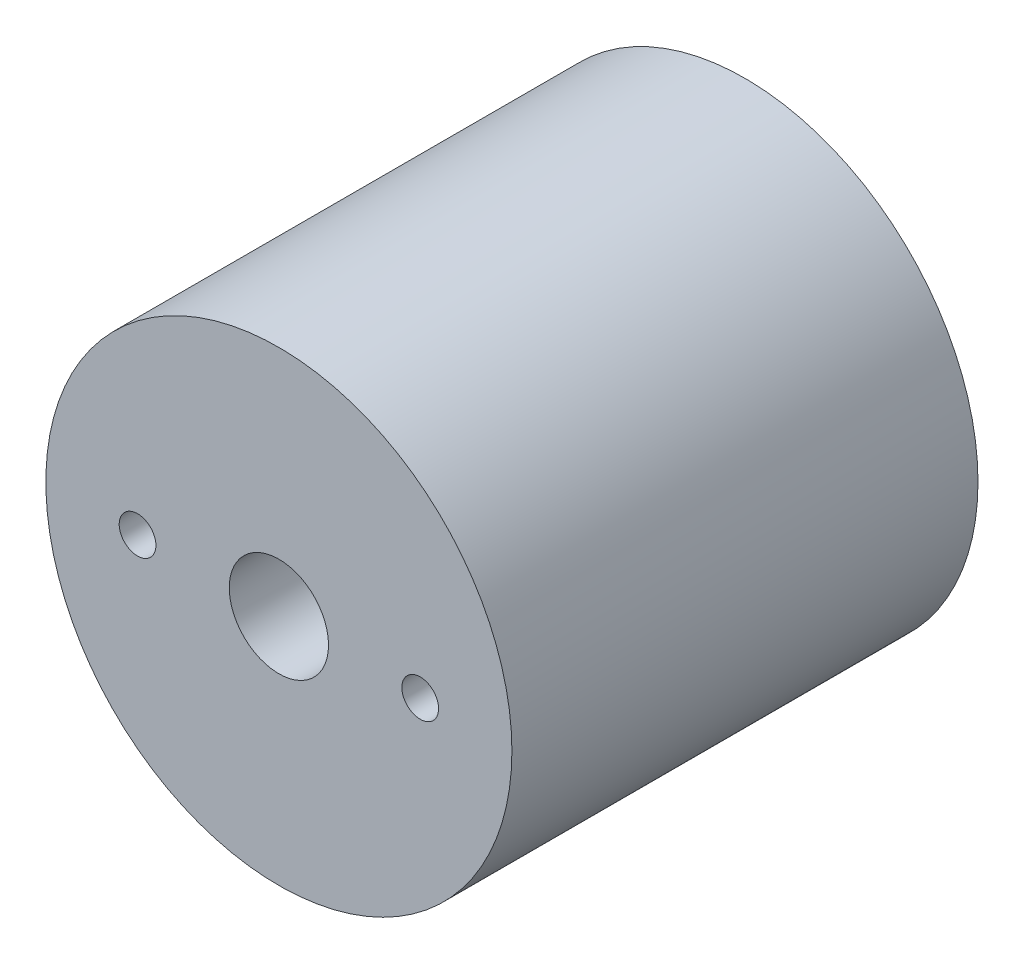
ISO-10303-21;
HEADER;
FILE_DESCRIPTION(('STEP AP214'),'2;1');
FILE_NAME('part.step','',(''),(''),'','','');
FILE_SCHEMA(('AUTOMOTIVE_DESIGN { 1 0 10303 214 1 1 1 1 }'));
ENDSEC;
DATA;
#1=APPLICATION_CONTEXT('core data for automotive mechanical design processes');
#2=APPLICATION_PROTOCOL_DEFINITION('international standard','automotive_design',2000,#1);
#3=PRODUCT_CONTEXT('',#1,'mechanical');
#4=PRODUCT('Part','Part','',(#3));
#5=PRODUCT_RELATED_PRODUCT_CATEGORY('part','',(#4));
#6=PRODUCT_DEFINITION_FORMATION('','',#4);
#7=PRODUCT_DEFINITION_CONTEXT('part definition',#1,'design');
#8=PRODUCT_DEFINITION('design','',#6,#7);
#9=PRODUCT_DEFINITION_SHAPE('','',#8);
#10=(LENGTH_UNIT() NAMED_UNIT(*) SI_UNIT(.MILLI.,.METRE.));
#11=(NAMED_UNIT(*) PLANE_ANGLE_UNIT() SI_UNIT($,.RADIAN.));
#12=(NAMED_UNIT(*) SI_UNIT($,.STERADIAN.) SOLID_ANGLE_UNIT());
#13=UNCERTAINTY_MEASURE_WITH_UNIT(LENGTH_MEASURE(1.E-05),#10,'distance_accuracy_value','');
#14=(GEOMETRIC_REPRESENTATION_CONTEXT(3) GLOBAL_UNCERTAINTY_ASSIGNED_CONTEXT((#13)) GLOBAL_UNIT_ASSIGNED_CONTEXT((#10,
#11,#12)) REPRESENTATION_CONTEXT('',''));
#15=CARTESIAN_POINT('',(0.,0.,0.));
#16=DIRECTION('',(0.,0.,1.));
#17=DIRECTION('',(1.,0.,0.));
#18=AXIS2_PLACEMENT_3D('',#15,#16,#17);
#19=CARTESIAN_POINT('',(0.,0.,25.4));
#20=DIRECTION('',(0.,0.,-1.));
#21=DIRECTION('',(-1.,0.,0.));
#22=AXIS2_PLACEMENT_3D('',#19,#20,#21);
#23=CYLINDRICAL_SURFACE('',#22,12.7);
#24=CARTESIAN_POINT('',(0.,0.,25.4));
#25=DIRECTION('',(0.,0.,1.));
#26=DIRECTION('',(1.,0.,0.));
#27=AXIS2_PLACEMENT_3D('',#24,#25,#26);
#28=CIRCLE('',#27,12.7);
#29=CARTESIAN_POINT('',(12.7,0.,25.4));
#30=VERTEX_POINT('',#29);
#31=EDGE_CURVE('E103',#30,#30,#28,.T.);
#32=ORIENTED_EDGE('',*,*,#31,.F.);
#33=EDGE_LOOP('',(#32));
#34=FACE_BOUND('',#33,.T.);
#35=CARTESIAN_POINT('',(0.,0.,0.));
#36=DIRECTION('',(0.,0.,1.));
#37=DIRECTION('',(1.,0.,0.));
#38=AXIS2_PLACEMENT_3D('',#35,#36,#37);
#39=CIRCLE('',#38,12.7);
#40=CARTESIAN_POINT('',(12.7,0.,0.));
#41=VERTEX_POINT('',#40);
#42=EDGE_CURVE('E98',#41,#41,#39,.T.);
#43=ORIENTED_EDGE('',*,*,#42,.T.);
#44=EDGE_LOOP('',(#43));
#45=FACE_BOUND('',#44,.T.);
#46=ADVANCED_FACE('F35',(#34,#45),#23,.T.);
#47=CARTESIAN_POINT('',(0.,0.,25.4));
#48=DIRECTION('',(0.,0.,1.));
#49=DIRECTION('',(1.,0.,0.));
#50=AXIS2_PLACEMENT_3D('',#47,#48,#49);
#51=PLANE('',#50);
#52=CARTESIAN_POINT('',(7.70254999999999,0.,25.4));
#53=DIRECTION('',(0.,0.,1.));
#54=DIRECTION('',(-1.,0.,0.));
#55=AXIS2_PLACEMENT_3D('',#52,#53,#54);
#56=CIRCLE('',#55,1.);
#57=CARTESIAN_POINT('',(6.70254999999999,0.,25.4));
#58=VERTEX_POINT('',#57);
#59=EDGE_CURVE('E74',#58,#58,#56,.T.);
#60=ORIENTED_EDGE('',*,*,#59,.F.);
#61=EDGE_LOOP('',(#60));
#62=FACE_BOUND('',#61,.T.);
#63=CARTESIAN_POINT('',(-7.70254999999999,0.,25.4));
#64=DIRECTION('',(0.,0.,1.));
#65=DIRECTION('',(1.,0.,0.));
#66=AXIS2_PLACEMENT_3D('',#63,#64,#65);
#67=CIRCLE('',#66,1.);
#68=CARTESIAN_POINT('',(-6.70254999999999,0.,25.4));
#69=VERTEX_POINT('',#68);
#70=EDGE_CURVE('E73',#69,#69,#67,.T.);
#71=ORIENTED_EDGE('',*,*,#70,.F.);
#72=EDGE_LOOP('',(#71));
#73=FACE_BOUND('',#72,.T.);
#74=CARTESIAN_POINT('',(0.,0.,25.4));
#75=DIRECTION('',(0.,0.,1.));
#76=DIRECTION('',(1.,0.,0.));
#77=AXIS2_PLACEMENT_3D('',#74,#75,#76);
#78=CIRCLE('',#77,2.70509999999999);
#79=CARTESIAN_POINT('',(2.70509999999999,0.,25.4));
#80=VERTEX_POINT('',#79);
#81=EDGE_CURVE('E85',#80,#80,#78,.T.);
#82=ORIENTED_EDGE('',*,*,#81,.F.);
#83=EDGE_LOOP('',(#82));
#84=FACE_BOUND('',#83,.T.);
#85=ORIENTED_EDGE('',*,*,#31,.T.);
#86=EDGE_LOOP('',(#85));
#87=FACE_BOUND('',#86,.T.);
#88=ADVANCED_FACE('F128',(#62,#73,#84,#87),#51,.T.);
#89=CARTESIAN_POINT('',(0.,0.,0.));
#90=DIRECTION('',(0.,0.,1.));
#91=DIRECTION('',(1.,0.,0.));
#92=AXIS2_PLACEMENT_3D('',#89,#90,#91);
#93=PLANE('',#92);
#94=CARTESIAN_POINT('',(0.,0.,0.));
#95=DIRECTION('',(0.,0.,-1.));
#96=DIRECTION('',(-1.,0.,0.));
#97=AXIS2_PLACEMENT_3D('',#94,#95,#96);
#98=CIRCLE('',#97,10.4);
#99=CARTESIAN_POINT('',(-10.4,0.,0.));
#100=VERTEX_POINT('',#99);
#101=EDGE_CURVE('E99',#100,#100,#98,.T.);
#102=ORIENTED_EDGE('',*,*,#101,.F.);
#103=EDGE_LOOP('',(#102));
#104=FACE_BOUND('',#103,.T.);
#105=ORIENTED_EDGE('',*,*,#42,.F.);
#106=EDGE_LOOP('',(#105));
#107=FACE_BOUND('',#106,.T.);
#108=ADVANCED_FACE('F134',(#104,#107),#93,.F.);
#109=CARTESIAN_POINT('',(0.,0.,5.5));
#110=DIRECTION('',(0.,0.,-1.));
#111=DIRECTION('',(-1.,0.,0.));
#112=AXIS2_PLACEMENT_3D('',#109,#110,#111);
#113=CYLINDRICAL_SURFACE('',#112,10.4);
#114=CARTESIAN_POINT('',(0.,0.,1.));
#115=DIRECTION('',(0.,0.,-1.));
#116=DIRECTION('',(-1.,0.,0.));
#117=AXIS2_PLACEMENT_3D('',#114,#115,#116);
#118=CIRCLE('',#117,10.4);
#119=CARTESIAN_POINT('',(-10.4,0.,1.));
#120=VERTEX_POINT('',#119);
#121=EDGE_CURVE('E92',#120,#120,#118,.F.);
#122=ORIENTED_EDGE('',*,*,#121,.T.);
#123=EDGE_LOOP('',(#122));
#124=FACE_BOUND('',#123,.T.);
#125=ORIENTED_EDGE('',*,*,#101,.T.);
#126=EDGE_LOOP('',(#125));
#127=FACE_BOUND('',#126,.T.);
#128=ADVANCED_FACE('F142',(#124,#127),#113,.F.);
#129=CARTESIAN_POINT('',(0.,0.,2.8));
#130=DIRECTION('',(0.,0.,-1.));
#131=DIRECTION('',(-1.,0.,0.));
#132=AXIS2_PLACEMENT_3D('',#129,#130,#131);
#133=PLANE('',#132);
#134=CARTESIAN_POINT('',(0.,0.,2.8));
#135=DIRECTION('',(0.,0.,-1.));
#136=DIRECTION('',(-1.,0.,0.));
#137=AXIS2_PLACEMENT_3D('',#134,#135,#136);
#138=CIRCLE('',#137,11.75);
#139=CARTESIAN_POINT('',(-11.75,0.,2.8));
#140=VERTEX_POINT('',#139);
#141=EDGE_CURVE('E89',#140,#140,#138,.T.);
#142=ORIENTED_EDGE('',*,*,#141,.T.);
#143=EDGE_LOOP('',(#142));
#144=FACE_BOUND('',#143,.T.);
#145=CARTESIAN_POINT('',(0.,0.,2.8));
#146=DIRECTION('',(0.,0.,-1.));
#147=DIRECTION('',(-1.,0.,0.));
#148=AXIS2_PLACEMENT_3D('',#145,#146,#147);
#149=CIRCLE('',#148,10.4);
#150=CARTESIAN_POINT('',(-10.4,0.,2.8));
#151=VERTEX_POINT('',#150);
#152=EDGE_CURVE('E102',#151,#151,#149,.F.);
#153=ORIENTED_EDGE('',*,*,#152,.T.);
#154=EDGE_LOOP('',(#153));
#155=FACE_BOUND('',#154,.T.);
#156=ADVANCED_FACE('F147',(#144,#155),#133,.T.);
#157=CARTESIAN_POINT('',(0.,0.,1.));
#158=DIRECTION('',(0.,0.,-1.));
#159=DIRECTION('',(-1.,0.,0.));
#160=AXIS2_PLACEMENT_3D('',#157,#158,#159);
#161=PLANE('',#160);
#162=CARTESIAN_POINT('',(0.,0.,1.));
#163=DIRECTION('',(0.,0.,-1.));
#164=DIRECTION('',(-1.,0.,0.));
#165=AXIS2_PLACEMENT_3D('',#162,#163,#164);
#166=CIRCLE('',#165,11.75);
#167=CARTESIAN_POINT('',(-11.75,0.,1.));
#168=VERTEX_POINT('',#167);
#169=EDGE_CURVE('E88',#168,#168,#166,.T.);
#170=ORIENTED_EDGE('',*,*,#169,.F.);
#171=EDGE_LOOP('',(#170));
#172=FACE_BOUND('',#171,.T.);
#173=ORIENTED_EDGE('',*,*,#121,.F.);
#174=EDGE_LOOP('',(#173));
#175=FACE_BOUND('',#174,.T.);
#176=ADVANCED_FACE('F158',(#172,#175),#161,.F.);
#177=CARTESIAN_POINT('',(0.,0.,2.8));
#178=DIRECTION('',(0.,0.,-1.));
#179=DIRECTION('',(-1.,0.,0.));
#180=AXIS2_PLACEMENT_3D('',#177,#178,#179);
#181=CYLINDRICAL_SURFACE('',#180,11.75);
#182=ORIENTED_EDGE('',*,*,#141,.F.);
#183=EDGE_LOOP('',(#182));
#184=FACE_BOUND('',#183,.T.);
#185=ORIENTED_EDGE('',*,*,#169,.T.);
#186=EDGE_LOOP('',(#185));
#187=FACE_BOUND('',#186,.T.);
#188=ADVANCED_FACE('F155',(#184,#187),#181,.F.);
#189=CARTESIAN_POINT('',(0.,0.,5.5));
#190=DIRECTION('',(0.,0.,-1.));
#191=DIRECTION('',(-1.,0.,0.));
#192=AXIS2_PLACEMENT_3D('',#189,#190,#191);
#193=PLANE('',#192);
#194=CARTESIAN_POINT('',(7.70254999999999,0.,5.5));
#195=DIRECTION('',(0.,0.,-1.));
#196=DIRECTION('',(-1.,0.,0.));
#197=AXIS2_PLACEMENT_3D('',#194,#195,#196);
#198=CIRCLE('',#197,1.);
#199=CARTESIAN_POINT('',(8.64855125448914,0.324162962882815,5.5));
#200=VERTEX_POINT('',#199);
#201=CARTESIAN_POINT('',(8.64855125448914,-0.324162962882819,5.5));
#202=VERTEX_POINT('',#201);
#203=EDGE_CURVE('E53',#200,#202,#198,.T.);
#204=ORIENTED_EDGE('',*,*,#203,.F.);
#205=CARTESIAN_POINT('',(0.,0.,5.5));
#206=DIRECTION('',(0.,0.,1.));
#207=DIRECTION('',(1.,0.,0.));
#208=AXIS2_PLACEMENT_3D('',#205,#206,#207);
#209=CIRCLE('',#208,8.65462422223118);
#210=CARTESIAN_POINT('',(-8.64855125448914,0.324162962882819,5.5));
#211=VERTEX_POINT('',#210);
#212=EDGE_CURVE('E59',#200,#211,#209,.T.);
#213=ORIENTED_EDGE('',*,*,#212,.T.);
#214=CARTESIAN_POINT('',(-7.70254999999999,0.,5.5));
#215=DIRECTION('',(0.,0.,-1.));
#216=DIRECTION('',(-1.,0.,0.));
#217=AXIS2_PLACEMENT_3D('',#214,#215,#216);
#218=CIRCLE('',#217,1.);
#219=CARTESIAN_POINT('',(-8.64855125448914,-0.324162962882815,5.49999999999999));
#220=VERTEX_POINT('',#219);
#221=EDGE_CURVE('E79',#220,#211,#218,.T.);
#222=ORIENTED_EDGE('',*,*,#221,.F.);
#223=EDGE_CURVE('E72',#220,#202,#209,.T.);
#224=ORIENTED_EDGE('',*,*,#223,.T.);
#225=EDGE_LOOP('',(#204,#213,#222,#224));
#226=FACE_BOUND('',#225,.T.);
#227=CARTESIAN_POINT('',(0.,0.,5.5));
#228=DIRECTION('',(0.,0.,-1.));
#229=DIRECTION('',(-1.,0.,0.));
#230=AXIS2_PLACEMENT_3D('',#227,#228,#229);
#231=CIRCLE('',#230,10.4);
#232=CARTESIAN_POINT('',(-10.4,0.,5.5));
#233=VERTEX_POINT('',#232);
#234=EDGE_CURVE('E95',#233,#233,#231,.T.);
#235=ORIENTED_EDGE('',*,*,#234,.T.);
#236=EDGE_LOOP('',(#235));
#237=FACE_BOUND('',#236,.T.);
#238=ADVANCED_FACE('F70',(#226,#237),#193,.T.);
#239=ORIENTED_EDGE('',*,*,#234,.F.);
#240=EDGE_LOOP('',(#239));
#241=FACE_BOUND('',#240,.T.);
#242=ORIENTED_EDGE('',*,*,#152,.F.);
#243=EDGE_LOOP('',(#242));
#244=FACE_BOUND('',#243,.T.);
#245=ADVANCED_FACE('F150',(#241,#244),#113,.F.);
#246=CARTESIAN_POINT('',(0.,0.,25.4));
#247=DIRECTION('',(0.,0.,1.));
#248=DIRECTION('',(1.,0.,0.));
#249=AXIS2_PLACEMENT_3D('',#246,#247,#248);
#250=CYLINDRICAL_SURFACE('',#249,2.70509999999999);
#251=CARTESIAN_POINT('',(0.,0.,19.1815824070187));
#252=DIRECTION('',(0.,0.,-1.));
#253=DIRECTION('',(-1.,0.,0.));
#254=AXIS2_PLACEMENT_3D('',#251,#252,#253);
#255=CIRCLE('',#254,2.70509999999999);
#256=CARTESIAN_POINT('',(-2.70509999999999,0.,19.1815824070187));
#257=VERTEX_POINT('',#256);
#258=EDGE_CURVE('E81',#257,#257,#255,.T.);
#259=ORIENTED_EDGE('',*,*,#258,.T.);
#260=EDGE_LOOP('',(#259));
#261=FACE_BOUND('',#260,.T.);
#262=ORIENTED_EDGE('',*,*,#81,.T.);
#263=EDGE_LOOP('',(#262));
#264=FACE_BOUND('',#263,.T.);
#265=ADVANCED_FACE('F165',(#261,#264),#250,.F.);
#266=CARTESIAN_POINT('',(0.,0.,25.402256058692));
#267=DIRECTION('',(0.,0.,-1.));
#268=DIRECTION('',(-1.,0.,0.));
#269=AXIS2_PLACEMENT_3D('',#266,#267,#268);
#270=CONICAL_SURFACE('',#269,0.,0.410189432476761);
#271=ORIENTED_EDGE('',*,*,#212,.F.);
#272=CARTESIAN_POINT('',(8.64864897635977,0.323877641912768,5.49980000000092));
#273=CARTESIAN_POINT('',(8.63934061057164,0.3510040325567,5.51884943463182));
#274=CARTESIAN_POINT('',(8.62928077350552,0.376647890178049,5.53946644809758));
#275=CARTESIAN_POINT('',(8.60805637747901,0.425166892885869,5.58303994481922));
#276=CARTESIAN_POINT('',(8.59689664290249,0.448053229441828,5.60598622362429));
#277=CARTESIAN_POINT('',(8.57395098184051,0.491167471541113,5.65325565096632));
#278=CARTESIAN_POINT('',(8.56217623646607,0.511428594843653,5.67755453731885));
#279=CARTESIAN_POINT('',(8.53804469108845,0.549969089693419,5.72745063957338));
#280=CARTESIAN_POINT('',(8.52568713554979,0.568245781422881,5.75304954426948));
#281=CARTESIAN_POINT('',(8.49079889525983,0.616539619044452,5.8254689789419));
#282=CARTESIAN_POINT('',(8.46781744985843,0.644657577230235,5.87333799631472));
#283=CARTESIAN_POINT('',(8.42107957996059,0.696366799002681,5.97106614030706));
#284=CARTESIAN_POINT('',(8.39732288032633,0.719956434588314,6.02092597490264));
#285=CARTESIAN_POINT('',(8.34910541254997,0.763565896492465,6.12252699001487));
#286=CARTESIAN_POINT('',(8.32464003047265,0.783548546430154,6.17428180272979));
#287=CARTESIAN_POINT('',(8.2754246846522,0.820215565997183,6.27882373833265));
#288=CARTESIAN_POINT('',(8.25067461381742,0.836898648429719,6.33161125529951));
#289=CARTESIAN_POINT('',(8.17259309842509,0.884864492584536,6.49885157086567));
#290=CARTESIAN_POINT('',(8.11899836731925,0.910979831343337,6.61467495951028));
#291=CARTESIAN_POINT('',(8.01191402420725,0.95267151566071,6.84829047770869));
#292=CARTESIAN_POINT('',(7.95842458093809,0.968236801858909,6.96608454098204));
#293=CARTESIAN_POINT('',(7.8518889761827,0.990283552910975,7.20298377933429));
#294=CARTESIAN_POINT('',(7.79884389470408,0.996747074041581,7.32209107906225));
#295=CARTESIAN_POINT('',(7.69361301312326,1.00134420865739,7.56074009429764));
#296=CARTESIAN_POINT('',(7.64142670591064,0.999482929128766,7.68028149852944));
#297=CARTESIAN_POINT('',(7.53177236401207,0.987037352994244,7.934026045178));
#298=CARTESIAN_POINT('',(7.47443785579917,0.975415270008675,8.06823641411975));
#299=CARTESIAN_POINT('',(7.36126645391966,0.941819347937837,8.33624583230526));
#300=CARTESIAN_POINT('',(7.30543163240326,0.919831893583416,8.47004410689416));
#301=CARTESIAN_POINT('',(7.22340366461408,0.878260194908786,8.66893411893837));
#302=CARTESIAN_POINT('',(7.19646204688445,0.863055826380447,8.73464719319933));
#303=CARTESIAN_POINT('',(7.14313455257352,0.82948737936719,8.86548389744469));
#304=CARTESIAN_POINT('',(7.11674856271073,0.811123952091282,8.93060764600625));
#305=CARTESIAN_POINT('',(7.06468303213613,0.770848120503551,9.05986787951418));
#306=CARTESIAN_POINT('',(7.0390021155346,0.748943303082037,9.12400616094694));
#307=CARTESIAN_POINT('',(6.98845170677802,0.700915656861221,9.25099310447928));
#308=CARTESIAN_POINT('',(6.96358168590364,0.674795645342749,9.31384259655405));
#309=CARTESIAN_POINT('',(6.92937774966778,0.634378693803934,9.40077401740089));
#310=CARTESIAN_POINT('',(6.91959249646013,0.622277767764924,9.42570301091102));
#311=CARTESIAN_POINT('',(6.90022905731023,0.597104145166165,9.47514709146281));
#312=CARTESIAN_POINT('',(6.89065088448794,0.584031387265748,9.49966215225758));
#313=CARTESIAN_POINT('',(6.86219210014717,0.543058096923864,9.57266788147663));
#314=CARTESIAN_POINT('',(6.84367156670992,0.513499570711043,9.62040463240237));
#315=CARTESIAN_POINT('',(6.80781888926628,0.448193874140282,9.71321044159531));
#316=CARTESIAN_POINT('',(6.79050992391268,0.412356959335114,9.75822595447601));
#317=CARTESIAN_POINT('',(6.75855580626231,0.332718138647812,9.84165129711684));
#318=CARTESIAN_POINT('',(6.74388868867151,0.288988605235515,9.88011543611039));
#319=CARTESIAN_POINT('',(6.72715230408387,0.221293602689739,9.92412312793742));
#320=CARTESIAN_POINT('',(6.72287283272903,0.201650181746718,9.93539117450844));
#321=CARTESIAN_POINT('',(6.71534986776905,0.160832491698121,9.95521609417633));
#322=CARTESIAN_POINT('',(6.71210582988147,0.139659034069055,9.96377439165167));
#323=CARTESIAN_POINT('',(6.70690212742358,0.0957946038218387,9.97750971801253));
#324=CARTESIAN_POINT('',(6.70495715366603,0.0730893688871462,9.98264806932624));
#325=CARTESIAN_POINT('',(6.70265126512902,0.0270474790980981,9.98874047693713));
#326=CARTESIAN_POINT('',(6.70228856259611,0.00371156684876878,9.9896992555878));
#327=CARTESIAN_POINT('',(6.70314282534907,-0.04019821317923,9.98744183484065));
#328=CARTESIAN_POINT('',(6.70419447060449,-0.0607997788338196,9.98466256547625));
#329=CARTESIAN_POINT('',(6.70748013857804,-0.101234825464741,9.97598442336477));
#330=CARTESIAN_POINT('',(6.70971518286369,-0.121067626906977,9.97008285530122));
#331=CARTESIAN_POINT('',(6.71621520313195,-0.166930071591991,9.95293439692706));
#332=CARTESIAN_POINT('',(6.72092882964086,-0.192450205836015,9.94050842677616));
#333=CARTESIAN_POINT('',(6.73172624066797,-0.24109196034529,9.91208956671284));
#334=CARTESIAN_POINT('',(6.7378134107325,-0.264207444310884,9.89608786420168));
#335=CARTESIAN_POINT('',(6.75588980923544,-0.324747277847893,9.84865695216738));
#336=CARTESIAN_POINT('',(6.76887339169507,-0.359849467368048,9.81467973198874));
#337=CARTESIAN_POINT('',(6.7965209154108,-0.424677741650031,9.74259792276114));
#338=CARTESIAN_POINT('',(6.8111896989827,-0.454387667528767,9.70448145795316));
#339=CARTESIAN_POINT('',(6.84747648297634,-0.520353633139236,9.61056051627858));
#340=CARTESIAN_POINT('',(6.86958769328196,-0.554696351805352,9.55361731908824));
#341=CARTESIAN_POINT('',(6.91510245075585,-0.617597068835162,9.43706655066811));
#342=CARTESIAN_POINT('',(6.93850847686115,-0.646143445418643,9.3774539134632));
#343=CARTESIAN_POINT('',(6.98635213536237,-0.698806877217307,9.25629929494509));
#344=CARTESIAN_POINT('',(7.01079459229698,-0.722899567527686,9.19474873862179));
#345=CARTESIAN_POINT('',(7.06036579483828,-0.767269924996384,9.07064167294978));
#346=CARTESIAN_POINT('',(7.08549397746207,-0.787550619948546,9.00808600518109));
#347=CARTESIAN_POINT('',(7.13820507612207,-0.826232884258234,8.87762173079875));
#348=CARTESIAN_POINT('',(7.16583255217875,-0.844386329368369,8.80965797844328));
#349=CARTESIAN_POINT('',(7.22166399518129,-0.877381138374042,8.67316019219176));
#350=CARTESIAN_POINT('',(7.24986807899155,-0.892221823441556,8.60462604439313));
#351=CARTESIAN_POINT('',(7.33529347458961,-0.932252405565348,8.39832270357271));
#352=CARTESIAN_POINT('',(7.39327851571338,-0.952915969642081,8.25997498395644));
#353=CARTESIAN_POINT('',(7.51059866849248,-0.983259604427923,7.98343900286777));
#354=CARTESIAN_POINT('',(7.56992647004239,-0.992989031543656,7.84525286062562));
#355=CARTESIAN_POINT('',(7.6898422907997,-1.00172368766601,7.5692163320837));
#356=CARTESIAN_POINT('',(7.75042922738225,-1.00073777773857,7.4313657626352));
#357=CARTESIAN_POINT('',(7.87068047254986,-0.98756377371283,7.16087412461103));
#358=CARTESIAN_POINT('',(7.93031483538026,-0.975725176203885,7.02820441736132));
#359=CARTESIAN_POINT('',(8.02025511674968,-0.948706999629656,6.83023795861871));
#360=CARTESIAN_POINT('',(8.05040543313896,-0.938112943045041,6.76423093736266));
#361=CARTESIAN_POINT('',(8.11072203759287,-0.913487030732868,6.63287456179564));
#362=CARTESIAN_POINT('',(8.14088832114589,-0.899455876592662,6.56752507609771));
#363=CARTESIAN_POINT('',(8.20155035201381,-0.86729154901836,6.43678575833435));
#364=CARTESIAN_POINT('',(8.2320445951226,-0.849102262640845,6.37140887293627));
#365=CARTESIAN_POINT('',(8.29271753172281,-0.808111279189214,6.24198792832033));
#366=CARTESIAN_POINT('',(8.32289637260069,-0.785311848003206,6.17794323132017));
#367=CARTESIAN_POINT('',(8.38226819995954,-0.734501399761056,6.05255727443897));
#368=CARTESIAN_POINT('',(8.41146880080017,-0.70655925608423,5.99119219695699));
#369=CARTESIAN_POINT('',(8.46872315405647,-0.644034579262692,5.87141844264428));
#370=CARTESIAN_POINT('',(8.49677839153598,-0.609460998934757,5.8130059125438));
#371=CARTESIAN_POINT('',(8.54691773728924,-0.537294925549767,5.70904707896655));
#372=CARTESIAN_POINT('',(8.56927922849337,-0.500858404285311,5.66286060685787));
#373=CARTESIAN_POINT('',(8.60087253738497,-0.439939813530254,5.59780915551076));
#374=CARTESIAN_POINT('',(8.61114270104867,-0.418419105138516,5.57669953097146));
#375=CARTESIAN_POINT('',(8.63071196308414,-0.372992461794199,5.53653370227389));
#376=CARTESIAN_POINT('',(8.64000728872238,-0.349077912860561,5.51748546747129));
#377=CARTESIAN_POINT('',(8.64864897636041,-0.323877641912065,5.49979999999966));
#378=B_SPLINE_CURVE_WITH_KNOTS('',3,(#272,#273,#274,#275,#276,#277,#278,#279,#280,#281,#282,
#283,#284,#285,#286,#287,#288,#289,#290,#291,#292,#293,#294,#295,#296,#297,#298,#299,#300,#301,
#302,#303,#304,#305,#306,#307,#308,#309,#310,#311,#312,#313,#314,#315,#316,#317,#318,#319,#320,
#321,#322,#323,#324,#325,#326,#327,#328,#329,#330,#331,#332,#333,#334,#335,#336,#337,#338,#339,
#340,#341,#342,#343,#344,#345,#346,#347,#348,#349,#350,#351,#352,#353,#354,#355,#356,#357,#358,
#359,#360,#361,#362,#363,#364,#365,#366,#367,#368,#369,#370,#371,#372,#373,#374,#375,#376,#377),
.UNSPECIFIED.,.F.,.F.,(4,2,2,2,2,2,2,2,2,2,2,2,2,2,2,2,2,2,2,2,2,2,2,2,2,2,2,2,2,2,2,2,2,2,2,2,
2,2,2,2,2,2,2,2,2,2,2,2,2,2,2,2,4),(0.,0.103071662836696,0.205709809667447,0.306886259468155,
0.408197683877118,0.588151112560315,0.768169116574827,0.949948024229638,1.13179770652179,
1.52195859521474,1.91252785001543,2.30386602177783,2.69496415362809,3.13383687547593,
3.57328768474705,3.79112348597815,4.00891443618406,4.22624483899315,4.44343058320076,
4.53157591080711,4.61972680675466,4.79677694598056,4.97660235106505,5.15485564357305,
5.22381220165562,5.29273245234364,5.36241947431304,5.43202773890336,5.49416714919442,
5.55636028890985,5.64218999092394,5.72823360506201,5.87902627465918,6.03026361780597,
6.24000260071539,6.45015804984089,6.66143121443798,6.87253585310772,7.09917609586389,
7.32586273763559,7.77964422005256,8.23136901246351,8.6827202787416,9.12002830629217,
9.33997066948559,9.55986817495154,9.78292943151356,10.0058813187065,10.226039901075,
10.4459033226916,10.6340331003043,10.7294223867454,10.8251681828203),.UNSPECIFIED.);
#379=EDGE_CURVE('E11',#200,#202,#378,.T.);
#380=ORIENTED_EDGE('',*,*,#379,.T.);
#381=ORIENTED_EDGE('',*,*,#223,.F.);
#382=CARTESIAN_POINT('',(-8.64864897636023,-0.323877641911449,5.4998));
#383=CARTESIAN_POINT('',(-8.63934061057214,-0.351004032555347,5.51884943463078));
#384=CARTESIAN_POINT('',(-8.62928077350608,-0.376647890176666,5.53946644809643));
#385=CARTESIAN_POINT('',(-8.60805637747968,-0.425166892884441,5.58303994481784));
#386=CARTESIAN_POINT('',(-8.59689664290321,-0.448053229440383,5.6059862236228));
#387=CARTESIAN_POINT('',(-8.57395098184134,-0.49116747153964,5.65325565096461));
#388=CARTESIAN_POINT('',(-8.56217623646695,-0.51142859484217,5.67755453731702));
#389=CARTESIAN_POINT('',(-8.53804469108944,-0.549969089691917,5.72745063957134));
#390=CARTESIAN_POINT('',(-8.52568713555083,-0.568245781421372,5.75304954426733));
#391=CARTESIAN_POINT('',(-8.49079889526105,-0.616539619042888,5.82546897893938));
#392=CARTESIAN_POINT('',(-8.46781744985976,-0.644657577228641,5.87333799631193));
#393=CARTESIAN_POINT('',(-8.42107957996217,-0.696366799001044,5.97106614030375));
#394=CARTESIAN_POINT('',(-8.39732288032804,-0.719956434586666,6.02092597489906));
#395=CARTESIAN_POINT('',(-8.34910541255192,-0.763565896490813,6.12252699001076));
#396=CARTESIAN_POINT('',(-8.32464003047472,-0.783548546428509,6.17428180272541));
#397=CARTESIAN_POINT('',(-8.27542468465451,-0.820215565995568,6.27882373832773));
#398=CARTESIAN_POINT('',(-8.25067461381984,-0.836898648428127,6.33161125529433));
#399=CARTESIAN_POINT('',(-8.17259309842786,-0.884864492583055,6.49885157085971));
#400=CARTESIAN_POINT('',(-8.11899836732224,-0.910979831341963,6.61467495950381));
#401=CARTESIAN_POINT('',(-8.01191402421066,-0.952671515659595,6.8482904777012));
#402=CARTESIAN_POINT('',(-7.95842458094171,-0.968236801857945,6.96608454097405));
#403=CARTESIAN_POINT('',(-7.85188897618672,-0.990283552910359,7.20298377932528));
#404=CARTESIAN_POINT('',(-7.7988438947083,-0.996747074041162,7.32209107905273));
#405=CARTESIAN_POINT('',(-7.69361301312788,-1.00134420865742,7.5607400942871));
#406=CARTESIAN_POINT('',(-7.64142670591545,-0.999482929129048,7.68028149851839));
#407=CARTESIAN_POINT('',(-7.53177236401722,-0.987037352995123,7.93402604516599));
#408=CARTESIAN_POINT('',(-7.47443785580448,-0.975415270009901,8.06823641410729));
#409=CARTESIAN_POINT('',(-7.36126645392526,-0.941819347939849,8.33624583229191));
#410=CARTESIAN_POINT('',(-7.30543163240899,-0.919831893585868,8.47004410688036));
#411=CARTESIAN_POINT('',(-7.22340366462,-0.878260194912007,8.66893411892397));
#412=CARTESIAN_POINT('',(-7.19646204689042,-0.863055826383939,8.73464719318475));
#413=CARTESIAN_POINT('',(-7.14313455257959,-0.829487379371271,8.86548389742977));
#414=CARTESIAN_POINT('',(-7.11674856271684,-0.81112395209568,8.93060764599116));
#415=CARTESIAN_POINT('',(-7.0646830321423,-0.770848120508648,9.0598678794988));
#416=CARTESIAN_POINT('',(-7.0390021155408,-0.748943303087514,9.12400616093143));
#417=CARTESIAN_POINT('',(-6.98845170678425,-0.70091565686755,9.25099310446357));
#418=CARTESIAN_POINT('',(-6.96358168590987,-0.674795645349552,9.31384259653827));
#419=CARTESIAN_POINT('',(-6.92937774967362,-0.634378693811066,9.40077401738602));
#420=CARTESIAN_POINT('',(-6.9195924964656,-0.622277767771822,9.42570301089706));
#421=CARTESIAN_POINT('',(-6.90022905731497,-0.597104145172547,9.47514709145068));
#422=CARTESIAN_POINT('',(-6.89065088449231,-0.584031387271848,9.49966215224636));
#423=CARTESIAN_POINT('',(-6.86219210015046,-0.54305809692902,9.57266788146815));
#424=CARTESIAN_POINT('',(-6.84367156671251,-0.513499570715451,9.62040463239569));
#425=CARTESIAN_POINT('',(-6.8078188892675,-0.448193874142809,9.71321044159215));
#426=CARTESIAN_POINT('',(-6.79050992391323,-0.412356959336495,9.75822595447456));
#427=CARTESIAN_POINT('',(-6.75855580626172,-0.332718138646344,9.84165129711837));
#428=CARTESIAN_POINT('',(-6.74388868867045,-0.28898860523236,9.88011543611318));
#429=CARTESIAN_POINT('',(-6.72715230408268,-0.221293602684513,9.92412312794054));
#430=CARTESIAN_POINT('',(-6.72287283272795,-0.201650181741495,9.93539117451127));
#431=CARTESIAN_POINT('',(-6.71534986776821,-0.160832491692939,9.95521609417856));
#432=CARTESIAN_POINT('',(-6.71210582988075,-0.139659034063909,9.96377439165359));
#433=CARTESIAN_POINT('',(-6.7069021274231,-0.0957946038168265,9.9775097180138));
#434=CARTESIAN_POINT('',(-6.70495715366567,-0.0730893688822312,9.98264806932719));
#435=CARTESIAN_POINT('',(-6.7026512651289,-0.027047479093443,9.98874047693745));
#436=CARTESIAN_POINT('',(-6.7022885625961,-0.00371156684427648,9.98969925558783));
#437=CARTESIAN_POINT('',(-6.70314282534924,0.0401982131834099,9.98744183484019));
#438=CARTESIAN_POINT('',(-6.70419447060474,0.0607997788378548,9.98466256547559));
#439=CARTESIAN_POINT('',(-6.70748013857842,0.101234825468463,9.97598442336377));
#440=CARTESIAN_POINT('',(-6.70971518286413,0.121067626910531,9.97008285530007));
#441=CARTESIAN_POINT('',(-6.71621520313255,0.166930071595583,9.95293439692547));
#442=CARTESIAN_POINT('',(-6.72092882964159,0.192450205839778,9.94050842677423));
#443=CARTESIAN_POINT('',(-6.73172624066897,0.241091960349342,9.91208956671021));
#444=CARTESIAN_POINT('',(-6.73781341073364,0.264207444315053,9.89608786419868));
#445=CARTESIAN_POINT('',(-6.75588980923704,0.324747277852604,9.8486569521632));
#446=CARTESIAN_POINT('',(-6.76887339169701,0.359849467373103,9.81467973198369));
#447=CARTESIAN_POINT('',(-6.79652091541342,0.424677741655658,9.74259792275432));
#448=CARTESIAN_POINT('',(-6.81118969898567,0.45438766753462,9.70448145794544));
#449=CARTESIAN_POINT('',(-6.84747648298029,0.520353633145792,9.61056051626838));
#450=CARTESIAN_POINT('',(-6.86958769328656,0.554696351812302,9.55361731907641));
#451=CARTESIAN_POINT('',(-6.91510245076177,0.617597068842742,9.43706655065302));
#452=CARTESIAN_POINT('',(-6.93850847686773,0.646143445426458,9.37745391344646));
#453=CARTESIAN_POINT('',(-6.98635213537031,0.698806877225476,9.25629929492506));
#454=CARTESIAN_POINT('',(-7.01079459230561,0.722899567535971,9.19474873860009));
#455=CARTESIAN_POINT('',(-7.06036579484831,0.7672699250048,9.07064167292477));
#456=CARTESIAN_POINT('',(-7.0854939774728,0.787550619956976,9.00808600515442));
#457=CARTESIAN_POINT('',(-7.13820507613405,0.826232884266426,8.87762173076923));
#458=CARTESIAN_POINT('',(-7.16583255219125,0.844386329376334,8.80965797841256));
#459=CARTESIAN_POINT('',(-7.22166399519487,0.877381138381501,8.67316019215867));
#460=CARTESIAN_POINT('',(-7.24986807900568,0.892221823448736,8.60462604435886));
#461=CARTESIAN_POINT('',(-7.33529347460537,0.932252405571605,8.39832270353493));
#462=CARTESIAN_POINT('',(-7.39327851573024,0.952915969647608,8.25997498391635));
#463=CARTESIAN_POINT('',(-7.51059866851155,0.983259604431697,7.98343900282316));
#464=CARTESIAN_POINT('',(-7.56992647006256,0.992989031546411,7.84525286057881));
#465=CARTESIAN_POINT('',(-7.68984229082207,1.00172368766636,7.56921633203257));
#466=CARTESIAN_POINT('',(-7.75042922740573,1.00073777773753,7.43136576258196));
#467=CARTESIAN_POINT('',(-7.87068047257355,0.987563773708753,7.16087412455816));
#468=CARTESIAN_POINT('',(-7.93031483540302,0.975725176198534,7.02820441731089));
#469=CARTESIAN_POINT('',(-8.02025511677099,0.948706999622512,6.830237958572));
#470=CARTESIAN_POINT('',(-8.05040543315977,0.938112943037315,6.76423093731719));
#471=CARTESIAN_POINT('',(-8.11072203761266,0.913487030724013,6.63287456175267));
#472=CARTESIAN_POINT('',(-8.14088832116517,0.899455876583259,6.56752507605602));
#473=CARTESIAN_POINT('',(-8.20155035203204,0.867291549007864,6.4367857582952));
#474=CARTESIAN_POINT('',(-8.2320445951403,0.849102262629803,6.3714088728984));
#475=CARTESIAN_POINT('',(-8.2927175317394,0.808111279177089,6.24198792828506));
#476=CARTESIAN_POINT('',(-8.32289637261671,0.785311847990545,6.17794323128623));
#477=CARTESIAN_POINT('',(-8.38226819997438,0.734501399747322,6.05255727440774));
#478=CARTESIAN_POINT('',(-8.41146880081439,0.706559256069961,5.99119219692715));
#479=CARTESIAN_POINT('',(-8.46872315406938,0.644034579247327,5.87141844261736));
#480=CARTESIAN_POINT('',(-8.4967783915482,0.609460998918834,5.81300591251839));
#481=CARTESIAN_POINT('',(-8.54691773729846,0.537294925535067,5.7090470789475));
#482=CARTESIAN_POINT('',(-8.5692792285004,0.500858404272834,5.66286060684337));
#483=CARTESIAN_POINT('',(-8.60087253738894,0.439939813522061,5.5978091555026));
#484=CARTESIAN_POINT('',(-8.61114270105165,0.418419105131937,5.57669953096535));
#485=CARTESIAN_POINT('',(-8.63071196308528,0.372992461791251,5.53653370227157));
#486=CARTESIAN_POINT('',(-8.64000728872267,0.349077912859634,5.5174854674707));
#487=CARTESIAN_POINT('',(-8.64864897635996,0.323877641913387,5.49980000000058));
#488=B_SPLINE_CURVE_WITH_KNOTS('',3,(#382,#383,#384,#385,#386,#387,#388,#389,#390,#391,#392,
#393,#394,#395,#396,#397,#398,#399,#400,#401,#402,#403,#404,#405,#406,#407,#408,#409,#410,#411,
#412,#413,#414,#415,#416,#417,#418,#419,#420,#421,#422,#423,#424,#425,#426,#427,#428,#429,#430,
#431,#432,#433,#434,#435,#436,#437,#438,#439,#440,#441,#442,#443,#444,#445,#446,#447,#448,#449,
#450,#451,#452,#453,#454,#455,#456,#457,#458,#459,#460,#461,#462,#463,#464,#465,#466,#467,#468,
#469,#470,#471,#472,#473,#474,#475,#476,#477,#478,#479,#480,#481,#482,#483,#484,#485,#486,#487),
.UNSPECIFIED.,.F.,.F.,(4,2,2,2,2,2,2,2,2,2,2,2,2,2,2,2,2,2,2,2,2,2,2,2,2,2,2,2,2,2,2,2,2,2,2,2,
2,2,2,2,2,2,2,2,2,2,2,2,2,2,2,2,4),(0.,0.103071662836382,0.205709809666819,0.306886259467211,
0.408197683875859,0.588151112558239,0.768169116571931,0.94994802422592,1.13179770651725,
1.52195859520864,1.91252785000777,2.30386602176854,2.69496415361718,3.1338368754635,
3.57328768473308,3.79112348596345,4.00891443616864,4.22624483897703,4.44343058318395,
4.53157591079329,4.61972680674384,4.79677694597587,4.97660235106682,5.15485564358103,
5.2238122016631,5.29273245235061,5.36241947431948,5.43202773890929,5.49416714920001,
5.55636028891511,5.64218999093016,5.7282336050692,5.8790262746691,6.03026361781862,
6.24000260073317,6.45015804986382,6.66143121446609,6.87253585314101,7.09917609590081,
7.32586273767616,7.77964422010041,8.23136901251852,8.68272027880375,9.12002830634684,
9.33997066953654,9.55986817499877,9.78292943155717,10.0058813187464,10.2260399011113,
10.4459033227243,10.6340331003209,10.7294223867537,10.8251681828203),.UNSPECIFIED.);
#489=EDGE_CURVE('E47',#220,#211,#488,.T.);
#490=ORIENTED_EDGE('',*,*,#489,.T.);
#491=EDGE_LOOP('',(#271,#380,#381,#490));
#492=FACE_BOUND('',#491,.T.);
#493=ORIENTED_EDGE('',*,*,#258,.F.);
#494=EDGE_LOOP('',(#493));
#495=FACE_BOUND('',#494,.T.);
#496=ADVANCED_FACE('F77',(#492,#495),#270,.F.);
#497=CARTESIAN_POINT('',(-7.70254999999999,0.,0.));
#498=DIRECTION('',(0.,0.,1.));
#499=DIRECTION('',(1.,0.,0.));
#500=AXIS2_PLACEMENT_3D('',#497,#498,#499);
#501=CYLINDRICAL_SURFACE('',#500,1.);
#502=ORIENTED_EDGE('',*,*,#221,.T.);
#503=ORIENTED_EDGE('',*,*,#489,.F.);
#504=EDGE_LOOP('',(#502,#503));
#505=FACE_BOUND('',#504,.T.);
#506=ORIENTED_EDGE('',*,*,#70,.T.);
#507=EDGE_LOOP('',(#506));
#508=FACE_BOUND('',#507,.T.);
#509=ADVANCED_FACE('F119',(#505,#508),#501,.F.);
#510=CARTESIAN_POINT('',(7.70254999999999,0.,0.));
#511=DIRECTION('',(0.,0.,1.));
#512=DIRECTION('',(1.,0.,0.));
#513=AXIS2_PLACEMENT_3D('',#510,#511,#512);
#514=CYLINDRICAL_SURFACE('',#513,1.);
#515=ORIENTED_EDGE('',*,*,#203,.T.);
#516=ORIENTED_EDGE('',*,*,#379,.F.);
#517=EDGE_LOOP('',(#515,#516));
#518=FACE_BOUND('',#517,.T.);
#519=ORIENTED_EDGE('',*,*,#59,.T.);
#520=EDGE_LOOP('',(#519));
#521=FACE_BOUND('',#520,.T.);
#522=ADVANCED_FACE('F65',(#518,#521),#514,.F.);
#523=CLOSED_SHELL('',(#46,#88,#108,#128,#156,#176,#188,#238,#245,#265,#496,#509,#522));
#524=MANIFOLD_SOLID_BREP('B2',#523);
#525=ADVANCED_BREP_SHAPE_REPRESENTATION('',(#18,#524),#14);
#526=SHAPE_DEFINITION_REPRESENTATION(#9,#525);
ENDSEC;
END-ISO-10303-21;
